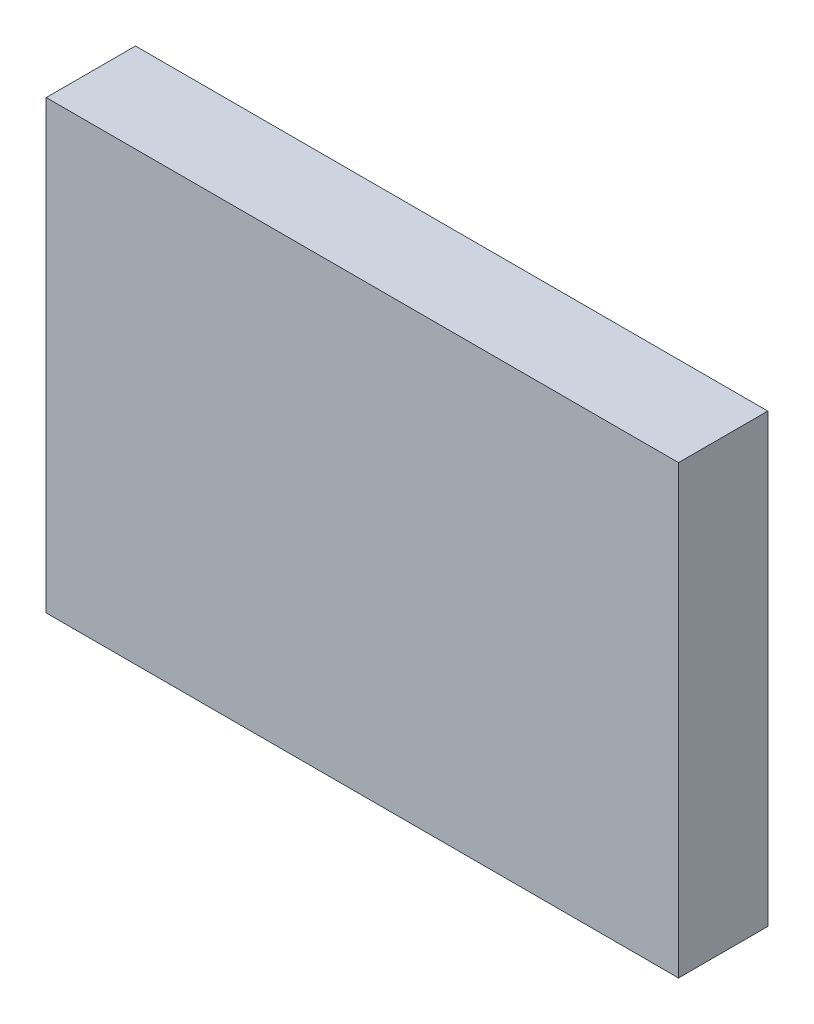
ISO-10303-21;
HEADER;
FILE_DESCRIPTION(('STEP AP214'),'2;1');
FILE_NAME('part.step','',(''),(''),'','','');
FILE_SCHEMA(('AUTOMOTIVE_DESIGN { 1 0 10303 214 1 1 1 1 }'));
ENDSEC;
DATA;
#1=APPLICATION_CONTEXT('core data for automotive mechanical design processes');
#2=APPLICATION_PROTOCOL_DEFINITION('international standard','automotive_design',2000,#1);
#3=PRODUCT_CONTEXT('',#1,'mechanical');
#4=PRODUCT('Part','Part','',(#3));
#5=PRODUCT_RELATED_PRODUCT_CATEGORY('part','',(#4));
#6=PRODUCT_DEFINITION_FORMATION('','',#4);
#7=PRODUCT_DEFINITION_CONTEXT('part definition',#1,'design');
#8=PRODUCT_DEFINITION('design','',#6,#7);
#9=PRODUCT_DEFINITION_SHAPE('','',#8);
#10=(LENGTH_UNIT() NAMED_UNIT(*) SI_UNIT(.MILLI.,.METRE.));
#11=(NAMED_UNIT(*) PLANE_ANGLE_UNIT() SI_UNIT($,.RADIAN.));
#12=(NAMED_UNIT(*) SI_UNIT($,.STERADIAN.) SOLID_ANGLE_UNIT());
#13=UNCERTAINTY_MEASURE_WITH_UNIT(LENGTH_MEASURE(1.E-05),#10,'distance_accuracy_value','');
#14=(GEOMETRIC_REPRESENTATION_CONTEXT(3) GLOBAL_UNCERTAINTY_ASSIGNED_CONTEXT((#13)) GLOBAL_UNIT_ASSIGNED_CONTEXT((#10,
#11,#12)) REPRESENTATION_CONTEXT('',''));
#15=CARTESIAN_POINT('',(0.,0.,0.));
#16=DIRECTION('',(0.,0.,1.));
#17=DIRECTION('',(1.,0.,0.));
#18=AXIS2_PLACEMENT_3D('',#15,#16,#17);
#19=CARTESIAN_POINT('',(0.,0.,12.));
#20=DIRECTION('',(1.,0.,0.));
#21=DIRECTION('',(0.,0.,-1.));
#22=AXIS2_PLACEMENT_3D('',#19,#20,#21);
#23=PLANE('',#22);
#24=DIRECTION('',(0.,-1.,0.));
#25=VECTOR('',#24,1.);
#26=CARTESIAN_POINT('',(0.,0.,0.));
#27=LINE('',#26,#25);
#28=CARTESIAN_POINT('',(0.,60.,0.));
#29=VERTEX_POINT('',#28);
#30=CARTESIAN_POINT('',(0.,0.,0.));
#31=VERTEX_POINT('',#30);
#32=EDGE_CURVE('E96',#29,#31,#27,.T.);
#33=ORIENTED_EDGE('',*,*,#32,.T.);
#34=DIRECTION('',(0.,0.,-1.));
#35=VECTOR('',#34,1.);
#36=CARTESIAN_POINT('',(0.,0.,12.));
#37=LINE('',#36,#35);
#38=CARTESIAN_POINT('',(0.,0.,12.));
#39=VERTEX_POINT('',#38);
#40=EDGE_CURVE('E11',#39,#31,#37,.T.);
#41=ORIENTED_EDGE('',*,*,#40,.F.);
#42=DIRECTION('',(0.,-1.,0.));
#43=VECTOR('',#42,1.);
#44=CARTESIAN_POINT('',(0.,0.,12.));
#45=LINE('',#44,#43);
#46=CARTESIAN_POINT('',(0.,60.,12.));
#47=VERTEX_POINT('',#46);
#48=EDGE_CURVE('E84',#47,#39,#45,.T.);
#49=ORIENTED_EDGE('',*,*,#48,.F.);
#50=DIRECTION('',(0.,0.,-1.));
#51=VECTOR('',#50,1.);
#52=CARTESIAN_POINT('',(0.,60.,12.));
#53=LINE('',#52,#51);
#54=EDGE_CURVE('E92',#47,#29,#53,.T.);
#55=ORIENTED_EDGE('',*,*,#54,.T.);
#56=EDGE_LOOP('',(#33,#41,#49,#55));
#57=FACE_BOUND('',#56,.T.);
#58=ADVANCED_FACE('F33',(#57),#23,.F.);
#59=CARTESIAN_POINT('',(0.,0.,12.));
#60=DIRECTION('',(0.,1.,0.));
#61=DIRECTION('',(0.,0.,1.));
#62=AXIS2_PLACEMENT_3D('',#59,#60,#61);
#63=PLANE('',#62);
#64=DIRECTION('',(1.,0.,0.));
#65=VECTOR('',#64,1.);
#66=CARTESIAN_POINT('',(0.,0.,0.));
#67=LINE('',#66,#65);
#68=CARTESIAN_POINT('',(85.,0.,0.));
#69=VERTEX_POINT('',#68);
#70=EDGE_CURVE('E88',#31,#69,#67,.T.);
#71=ORIENTED_EDGE('',*,*,#70,.T.);
#72=DIRECTION('',(0.,0.,-1.));
#73=VECTOR('',#72,1.);
#74=CARTESIAN_POINT('',(85.,0.,12.));
#75=LINE('',#74,#73);
#76=CARTESIAN_POINT('',(85.,0.,12.));
#77=VERTEX_POINT('',#76);
#78=EDGE_CURVE('E41',#77,#69,#75,.T.);
#79=ORIENTED_EDGE('',*,*,#78,.F.);
#80=DIRECTION('',(1.,0.,0.));
#81=VECTOR('',#80,1.);
#82=CARTESIAN_POINT('',(0.,0.,12.));
#83=LINE('',#82,#81);
#84=EDGE_CURVE('E79',#39,#77,#83,.T.);
#85=ORIENTED_EDGE('',*,*,#84,.F.);
#86=ORIENTED_EDGE('',*,*,#40,.T.);
#87=EDGE_LOOP('',(#71,#79,#85,#86));
#88=FACE_BOUND('',#87,.T.);
#89=ADVANCED_FACE('F87',(#88),#63,.F.);
#90=CARTESIAN_POINT('',(85.,0.,12.));
#91=DIRECTION('',(-1.,0.,0.));
#92=DIRECTION('',(0.,0.,1.));
#93=AXIS2_PLACEMENT_3D('',#90,#91,#92);
#94=PLANE('',#93);
#95=DIRECTION('',(0.,1.,0.));
#96=VECTOR('',#95,1.);
#97=CARTESIAN_POINT('',(85.,0.,0.));
#98=LINE('',#97,#96);
#99=CARTESIAN_POINT('',(85.,60.,0.));
#100=VERTEX_POINT('',#99);
#101=EDGE_CURVE('E66',#69,#100,#98,.T.);
#102=ORIENTED_EDGE('',*,*,#101,.T.);
#103=DIRECTION('',(0.,0.,-1.));
#104=VECTOR('',#103,1.);
#105=CARTESIAN_POINT('',(85.,60.,12.));
#106=LINE('',#105,#104);
#107=CARTESIAN_POINT('',(85.,60.,12.));
#108=VERTEX_POINT('',#107);
#109=EDGE_CURVE('E89',#108,#100,#106,.T.);
#110=ORIENTED_EDGE('',*,*,#109,.F.);
#111=DIRECTION('',(0.,1.,0.));
#112=VECTOR('',#111,1.);
#113=CARTESIAN_POINT('',(85.,0.,12.));
#114=LINE('',#113,#112);
#115=EDGE_CURVE('E82',#77,#108,#114,.T.);
#116=ORIENTED_EDGE('',*,*,#115,.F.);
#117=ORIENTED_EDGE('',*,*,#78,.T.);
#118=EDGE_LOOP('',(#102,#110,#116,#117));
#119=FACE_BOUND('',#118,.T.);
#120=ADVANCED_FACE('F90',(#119),#94,.F.);
#121=CARTESIAN_POINT('',(0.,60.,12.));
#122=DIRECTION('',(0.,-1.,0.));
#123=DIRECTION('',(0.,0.,-1.));
#124=AXIS2_PLACEMENT_3D('',#121,#122,#123);
#125=PLANE('',#124);
#126=DIRECTION('',(-1.,0.,0.));
#127=VECTOR('',#126,1.);
#128=CARTESIAN_POINT('',(0.,60.,0.));
#129=LINE('',#128,#127);
#130=EDGE_CURVE('E72',#100,#29,#129,.T.);
#131=ORIENTED_EDGE('',*,*,#130,.T.);
#132=ORIENTED_EDGE('',*,*,#54,.F.);
#133=DIRECTION('',(-1.,0.,0.));
#134=VECTOR('',#133,1.);
#135=CARTESIAN_POINT('',(0.,60.,12.));
#136=LINE('',#135,#134);
#137=EDGE_CURVE('E49',#108,#47,#136,.T.);
#138=ORIENTED_EDGE('',*,*,#137,.F.);
#139=ORIENTED_EDGE('',*,*,#109,.T.);
#140=EDGE_LOOP('',(#131,#132,#138,#139));
#141=FACE_BOUND('',#140,.T.);
#142=ADVANCED_FACE('F103',(#141),#125,.F.);
#143=CARTESIAN_POINT('',(0.,60.,12.));
#144=DIRECTION('',(0.,0.,-1.));
#145=DIRECTION('',(-1.,0.,0.));
#146=AXIS2_PLACEMENT_3D('',#143,#144,#145);
#147=PLANE('',#146);
#148=ORIENTED_EDGE('',*,*,#48,.T.);
#149=ORIENTED_EDGE('',*,*,#84,.T.);
#150=ORIENTED_EDGE('',*,*,#115,.T.);
#151=ORIENTED_EDGE('',*,*,#137,.T.);
#152=EDGE_LOOP('',(#148,#149,#150,#151));
#153=FACE_BOUND('',#152,.T.);
#154=ADVANCED_FACE('F80',(#153),#147,.F.);
#155=CARTESIAN_POINT('',(0.,60.,0.));
#156=DIRECTION('',(0.,0.,-1.));
#157=DIRECTION('',(-1.,0.,0.));
#158=AXIS2_PLACEMENT_3D('',#155,#156,#157);
#159=PLANE('',#158);
#160=ORIENTED_EDGE('',*,*,#32,.F.);
#161=ORIENTED_EDGE('',*,*,#130,.F.);
#162=ORIENTED_EDGE('',*,*,#101,.F.);
#163=ORIENTED_EDGE('',*,*,#70,.F.);
#164=EDGE_LOOP('',(#160,#161,#162,#163));
#165=FACE_BOUND('',#164,.T.);
#166=ADVANCED_FACE('F106',(#165),#159,.T.);
#167=CLOSED_SHELL('',(#58,#89,#120,#142,#154,#166));
#168=MANIFOLD_SOLID_BREP('B2',#167);
#169=ADVANCED_BREP_SHAPE_REPRESENTATION('',(#18,#168),#14);
#170=SHAPE_DEFINITION_REPRESENTATION(#9,#169);
ENDSEC;
END-ISO-10303-21;
